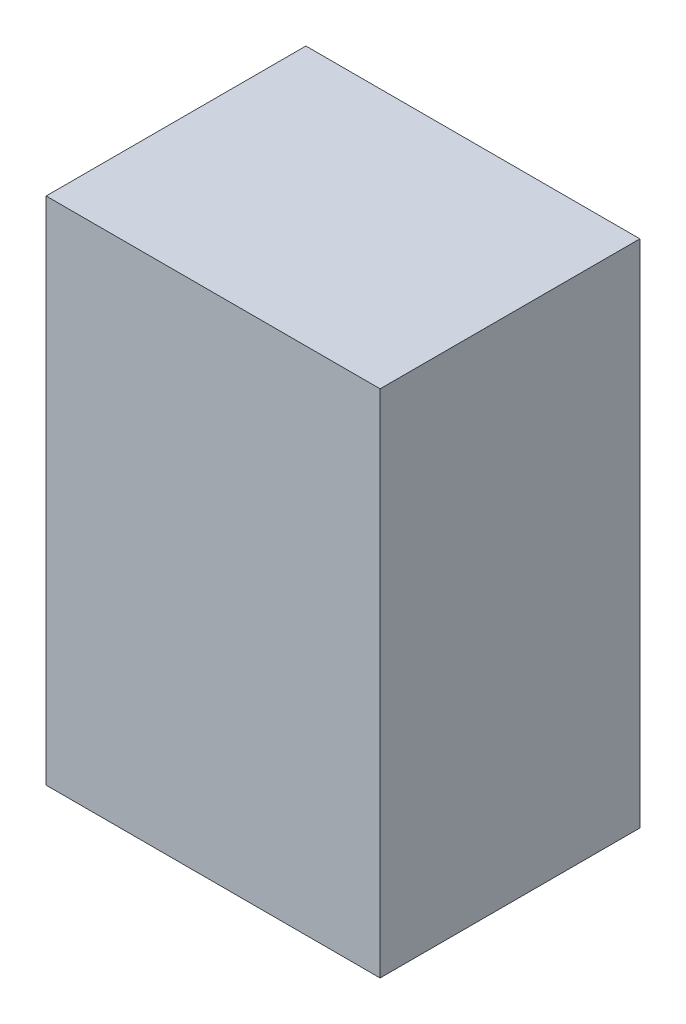
ISO-10303-21;
HEADER;
FILE_DESCRIPTION(('STEP AP214'),'2;1');
FILE_NAME('part.step','',(''),(''),'','','');
FILE_SCHEMA(('AUTOMOTIVE_DESIGN { 1 0 10303 214 1 1 1 1 }'));
ENDSEC;
DATA;
#1=APPLICATION_CONTEXT('core data for automotive mechanical design processes');
#2=APPLICATION_PROTOCOL_DEFINITION('international standard','automotive_design',2000,#1);
#3=PRODUCT_CONTEXT('',#1,'mechanical');
#4=PRODUCT('Part','Part','',(#3));
#5=PRODUCT_RELATED_PRODUCT_CATEGORY('part','',(#4));
#6=PRODUCT_DEFINITION_FORMATION('','',#4);
#7=PRODUCT_DEFINITION_CONTEXT('part definition',#1,'design');
#8=PRODUCT_DEFINITION('design','',#6,#7);
#9=PRODUCT_DEFINITION_SHAPE('','',#8);
#10=(LENGTH_UNIT() NAMED_UNIT(*) SI_UNIT(.MILLI.,.METRE.));
#11=(NAMED_UNIT(*) PLANE_ANGLE_UNIT() SI_UNIT($,.RADIAN.));
#12=(NAMED_UNIT(*) SI_UNIT($,.STERADIAN.) SOLID_ANGLE_UNIT());
#13=UNCERTAINTY_MEASURE_WITH_UNIT(LENGTH_MEASURE(1.E-05),#10,'distance_accuracy_value','');
#14=(GEOMETRIC_REPRESENTATION_CONTEXT(3) GLOBAL_UNCERTAINTY_ASSIGNED_CONTEXT((#13)) GLOBAL_UNIT_ASSIGNED_CONTEXT((#10,
#11,#12)) REPRESENTATION_CONTEXT('',''));
#15=CARTESIAN_POINT('',(0.,0.,0.));
#16=DIRECTION('',(0.,0.,1.));
#17=DIRECTION('',(1.,0.,0.));
#18=AXIS2_PLACEMENT_3D('',#15,#16,#17);
#19=CARTESIAN_POINT('',(45.72,139.7,35.56));
#20=DIRECTION('',(-1.,0.,0.));
#21=DIRECTION('',(0.,0.,1.));
#22=AXIS2_PLACEMENT_3D('',#19,#20,#21);
#23=PLANE('',#22);
#24=DIRECTION('',(0.,0.,-1.));
#25=VECTOR('',#24,1.);
#26=CARTESIAN_POINT('',(45.72,0.,35.56));
#27=LINE('',#26,#25);
#28=CARTESIAN_POINT('',(45.72,0.,35.56));
#29=VERTEX_POINT('',#28);
#30=CARTESIAN_POINT('',(45.72,0.,-35.56));
#31=VERTEX_POINT('',#30);
#32=EDGE_CURVE('E96',#29,#31,#27,.T.);
#33=ORIENTED_EDGE('',*,*,#32,.T.);
#34=DIRECTION('',(0.,-1.,0.));
#35=VECTOR('',#34,1.);
#36=CARTESIAN_POINT('',(45.72,139.7,-35.56));
#37=LINE('',#36,#35);
#38=CARTESIAN_POINT('',(45.72,139.7,-35.56));
#39=VERTEX_POINT('',#38);
#40=EDGE_CURVE('E11',#39,#31,#37,.T.);
#41=ORIENTED_EDGE('',*,*,#40,.F.);
#42=DIRECTION('',(0.,0.,-1.));
#43=VECTOR('',#42,1.);
#44=CARTESIAN_POINT('',(45.72,139.7,35.56));
#45=LINE('',#44,#43);
#46=CARTESIAN_POINT('',(45.72,139.7,35.56));
#47=VERTEX_POINT('',#46);
#48=EDGE_CURVE('E84',#47,#39,#45,.T.);
#49=ORIENTED_EDGE('',*,*,#48,.F.);
#50=DIRECTION('',(0.,-1.,0.));
#51=VECTOR('',#50,1.);
#52=CARTESIAN_POINT('',(45.72,139.7,35.56));
#53=LINE('',#52,#51);
#54=EDGE_CURVE('E92',#47,#29,#53,.T.);
#55=ORIENTED_EDGE('',*,*,#54,.T.);
#56=EDGE_LOOP('',(#33,#41,#49,#55));
#57=FACE_BOUND('',#56,.T.);
#58=ADVANCED_FACE('F33',(#57),#23,.F.);
#59=CARTESIAN_POINT('',(-45.72,139.7,-35.56));
#60=DIRECTION('',(0.,0.,1.));
#61=DIRECTION('',(1.,0.,0.));
#62=AXIS2_PLACEMENT_3D('',#59,#60,#61);
#63=PLANE('',#62);
#64=DIRECTION('',(-1.,0.,0.));
#65=VECTOR('',#64,1.);
#66=CARTESIAN_POINT('',(-45.72,0.,-35.56));
#67=LINE('',#66,#65);
#68=CARTESIAN_POINT('',(-45.72,0.,-35.56));
#69=VERTEX_POINT('',#68);
#70=EDGE_CURVE('E88',#31,#69,#67,.T.);
#71=ORIENTED_EDGE('',*,*,#70,.T.);
#72=DIRECTION('',(0.,-1.,0.));
#73=VECTOR('',#72,1.);
#74=CARTESIAN_POINT('',(-45.72,139.7,-35.56));
#75=LINE('',#74,#73);
#76=CARTESIAN_POINT('',(-45.72,139.7,-35.56));
#77=VERTEX_POINT('',#76);
#78=EDGE_CURVE('E41',#77,#69,#75,.T.);
#79=ORIENTED_EDGE('',*,*,#78,.F.);
#80=DIRECTION('',(-1.,0.,0.));
#81=VECTOR('',#80,1.);
#82=CARTESIAN_POINT('',(-45.72,139.7,-35.56));
#83=LINE('',#82,#81);
#84=EDGE_CURVE('E79',#39,#77,#83,.T.);
#85=ORIENTED_EDGE('',*,*,#84,.F.);
#86=ORIENTED_EDGE('',*,*,#40,.T.);
#87=EDGE_LOOP('',(#71,#79,#85,#86));
#88=FACE_BOUND('',#87,.T.);
#89=ADVANCED_FACE('F87',(#88),#63,.F.);
#90=CARTESIAN_POINT('',(-45.72,139.7,35.56));
#91=DIRECTION('',(1.,0.,0.));
#92=DIRECTION('',(0.,0.,-1.));
#93=AXIS2_PLACEMENT_3D('',#90,#91,#92);
#94=PLANE('',#93);
#95=DIRECTION('',(0.,0.,1.));
#96=VECTOR('',#95,1.);
#97=CARTESIAN_POINT('',(-45.72,0.,35.56));
#98=LINE('',#97,#96);
#99=CARTESIAN_POINT('',(-45.72,0.,35.56));
#100=VERTEX_POINT('',#99);
#101=EDGE_CURVE('E66',#69,#100,#98,.T.);
#102=ORIENTED_EDGE('',*,*,#101,.T.);
#103=DIRECTION('',(0.,-1.,0.));
#104=VECTOR('',#103,1.);
#105=CARTESIAN_POINT('',(-45.72,139.7,35.56));
#106=LINE('',#105,#104);
#107=CARTESIAN_POINT('',(-45.72,139.7,35.56));
#108=VERTEX_POINT('',#107);
#109=EDGE_CURVE('E89',#108,#100,#106,.T.);
#110=ORIENTED_EDGE('',*,*,#109,.F.);
#111=DIRECTION('',(0.,0.,1.));
#112=VECTOR('',#111,1.);
#113=CARTESIAN_POINT('',(-45.72,139.7,35.56));
#114=LINE('',#113,#112);
#115=EDGE_CURVE('E82',#77,#108,#114,.T.);
#116=ORIENTED_EDGE('',*,*,#115,.F.);
#117=ORIENTED_EDGE('',*,*,#78,.T.);
#118=EDGE_LOOP('',(#102,#110,#116,#117));
#119=FACE_BOUND('',#118,.T.);
#120=ADVANCED_FACE('F90',(#119),#94,.F.);
#121=CARTESIAN_POINT('',(-45.72,139.7,35.56));
#122=DIRECTION('',(0.,0.,-1.));
#123=DIRECTION('',(-1.,0.,0.));
#124=AXIS2_PLACEMENT_3D('',#121,#122,#123);
#125=PLANE('',#124);
#126=DIRECTION('',(1.,0.,0.));
#127=VECTOR('',#126,1.);
#128=CARTESIAN_POINT('',(-45.72,0.,35.56));
#129=LINE('',#128,#127);
#130=EDGE_CURVE('E72',#100,#29,#129,.T.);
#131=ORIENTED_EDGE('',*,*,#130,.T.);
#132=ORIENTED_EDGE('',*,*,#54,.F.);
#133=DIRECTION('',(1.,0.,0.));
#134=VECTOR('',#133,1.);
#135=CARTESIAN_POINT('',(-45.72,139.7,35.56));
#136=LINE('',#135,#134);
#137=EDGE_CURVE('E49',#108,#47,#136,.T.);
#138=ORIENTED_EDGE('',*,*,#137,.F.);
#139=ORIENTED_EDGE('',*,*,#109,.T.);
#140=EDGE_LOOP('',(#131,#132,#138,#139));
#141=FACE_BOUND('',#140,.T.);
#142=ADVANCED_FACE('F103',(#141),#125,.F.);
#143=CARTESIAN_POINT('',(0.,139.7,0.));
#144=DIRECTION('',(0.,-1.,0.));
#145=DIRECTION('',(0.,0.,-1.));
#146=AXIS2_PLACEMENT_3D('',#143,#144,#145);
#147=PLANE('',#146);
#148=ORIENTED_EDGE('',*,*,#48,.T.);
#149=ORIENTED_EDGE('',*,*,#84,.T.);
#150=ORIENTED_EDGE('',*,*,#115,.T.);
#151=ORIENTED_EDGE('',*,*,#137,.T.);
#152=EDGE_LOOP('',(#148,#149,#150,#151));
#153=FACE_BOUND('',#152,.T.);
#154=ADVANCED_FACE('F80',(#153),#147,.F.);
#155=CARTESIAN_POINT('',(0.,0.,0.));
#156=DIRECTION('',(0.,-1.,0.));
#157=DIRECTION('',(0.,0.,-1.));
#158=AXIS2_PLACEMENT_3D('',#155,#156,#157);
#159=PLANE('',#158);
#160=ORIENTED_EDGE('',*,*,#32,.F.);
#161=ORIENTED_EDGE('',*,*,#130,.F.);
#162=ORIENTED_EDGE('',*,*,#101,.F.);
#163=ORIENTED_EDGE('',*,*,#70,.F.);
#164=EDGE_LOOP('',(#160,#161,#162,#163));
#165=FACE_BOUND('',#164,.T.);
#166=ADVANCED_FACE('F106',(#165),#159,.T.);
#167=CLOSED_SHELL('',(#58,#89,#120,#142,#154,#166));
#168=MANIFOLD_SOLID_BREP('B2',#167);
#169=ADVANCED_BREP_SHAPE_REPRESENTATION('',(#18,#168),#14);
#170=SHAPE_DEFINITION_REPRESENTATION(#9,#169);
ENDSEC;
END-ISO-10303-21;
